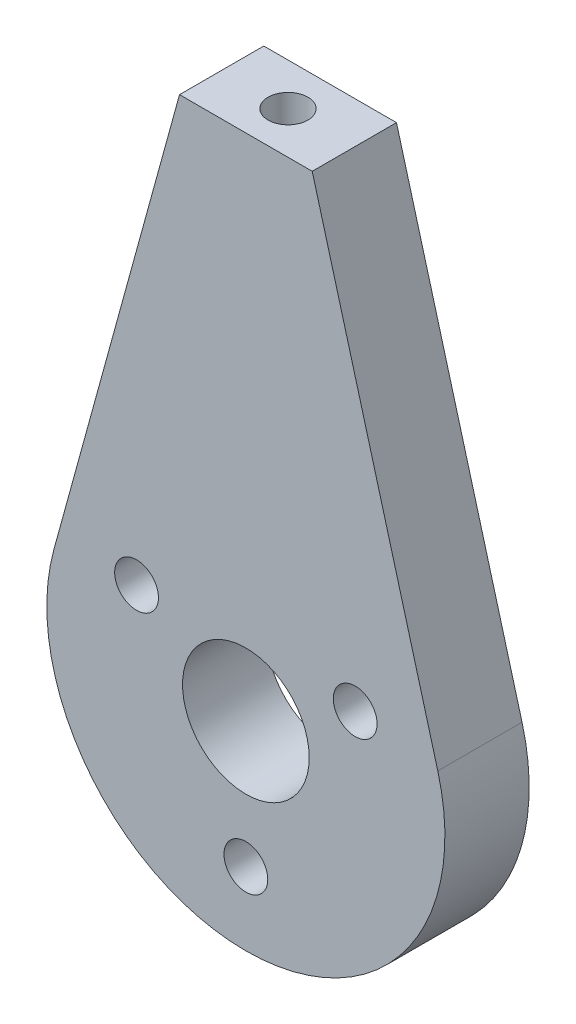
ISO-10303-21;
HEADER;
FILE_DESCRIPTION(('STEP AP214'),'2;1');
FILE_NAME('part.step','',(''),(''),'','','');
FILE_SCHEMA(('AUTOMOTIVE_DESIGN { 1 0 10303 214 1 1 1 1 }'));
ENDSEC;
DATA;
#1=APPLICATION_CONTEXT('core data for automotive mechanical design processes');
#2=APPLICATION_PROTOCOL_DEFINITION('international standard','automotive_design',2000,#1);
#3=PRODUCT_CONTEXT('',#1,'mechanical');
#4=PRODUCT('Part','Part','',(#3));
#5=PRODUCT_RELATED_PRODUCT_CATEGORY('part','',(#4));
#6=PRODUCT_DEFINITION_FORMATION('','',#4);
#7=PRODUCT_DEFINITION_CONTEXT('part definition',#1,'design');
#8=PRODUCT_DEFINITION('design','',#6,#7);
#9=PRODUCT_DEFINITION_SHAPE('','',#8);
#10=(LENGTH_UNIT() NAMED_UNIT(*) SI_UNIT(.MILLI.,.METRE.));
#11=(NAMED_UNIT(*) PLANE_ANGLE_UNIT() SI_UNIT($,.RADIAN.));
#12=(NAMED_UNIT(*) SI_UNIT($,.STERADIAN.) SOLID_ANGLE_UNIT());
#13=UNCERTAINTY_MEASURE_WITH_UNIT(LENGTH_MEASURE(1.E-05),#10,'distance_accuracy_value','');
#14=(GEOMETRIC_REPRESENTATION_CONTEXT(3) GLOBAL_UNCERTAINTY_ASSIGNED_CONTEXT((#13)) GLOBAL_UNIT_ASSIGNED_CONTEXT((#10,
#11,#12)) REPRESENTATION_CONTEXT('',''));
#15=CARTESIAN_POINT('',(0.,0.,0.));
#16=DIRECTION('',(0.,0.,1.));
#17=DIRECTION('',(1.,0.,0.));
#18=AXIS2_PLACEMENT_3D('',#15,#16,#17);
#19=CARTESIAN_POINT('',(-14.4628281295073,3.97826626765148,3.175));
#20=DIRECTION('',(0.964188541967151,-0.265217751176765,0.));
#21=DIRECTION('',(0.265217751176765,0.964188541967151,0.));
#22=AXIS2_PLACEMENT_3D('',#19,#20,#21);
#23=PLANE('',#22);
#24=DIRECTION('',(-0.265217751176765,-0.964188541967151,0.));
#25=VECTOR('',#24,1.);
#26=CARTESIAN_POINT('',(-14.4628281295073,3.97826626765148,-3.175));
#27=LINE('',#26,#25);
#28=CARTESIAN_POINT('',(-5.,38.38,-3.175));
#29=VERTEX_POINT('',#28);
#30=CARTESIAN_POINT('',(-14.4628281295073,3.97826626765148,-3.175));
#31=VERTEX_POINT('',#30);
#32=EDGE_CURVE('E108',#29,#31,#27,.T.);
#33=ORIENTED_EDGE('',*,*,#32,.T.);
#34=DIRECTION('',(0.,0.,-1.));
#35=VECTOR('',#34,1.);
#36=CARTESIAN_POINT('',(-14.4628281295073,3.97826626765148,3.175));
#37=LINE('',#36,#35);
#38=CARTESIAN_POINT('',(-14.4628281295073,3.97826626765148,3.175));
#39=VERTEX_POINT('',#38);
#40=EDGE_CURVE('E11',#39,#31,#37,.T.);
#41=ORIENTED_EDGE('',*,*,#40,.F.);
#42=DIRECTION('',(-0.265217751176765,-0.964188541967151,0.));
#43=VECTOR('',#42,1.);
#44=CARTESIAN_POINT('',(-14.4628281295073,3.97826626765148,3.175));
#45=LINE('',#44,#43);
#46=CARTESIAN_POINT('',(-5.,38.38,3.175));
#47=VERTEX_POINT('',#46);
#48=EDGE_CURVE('E94',#47,#39,#45,.T.);
#49=ORIENTED_EDGE('',*,*,#48,.F.);
#50=DIRECTION('',(0.,0.,-1.));
#51=VECTOR('',#50,1.);
#52=CARTESIAN_POINT('',(-5.,38.38,3.175));
#53=LINE('',#52,#51);
#54=EDGE_CURVE('E61',#47,#29,#53,.T.);
#55=ORIENTED_EDGE('',*,*,#54,.T.);
#56=EDGE_LOOP('',(#33,#41,#49,#55));
#57=FACE_BOUND('',#56,.T.);
#58=ADVANCED_FACE('F45',(#57),#23,.F.);
#59=CARTESIAN_POINT('',(0.,0.,3.175));
#60=DIRECTION('',(0.,0.,-1.));
#61=DIRECTION('',(-1.,0.,0.));
#62=AXIS2_PLACEMENT_3D('',#59,#60,#61);
#63=CYLINDRICAL_SURFACE('',#62,15.);
#64=CARTESIAN_POINT('',(0.,0.,-3.175));
#65=DIRECTION('',(0.,0.,1.));
#66=DIRECTION('',(1.,0.,0.));
#67=AXIS2_PLACEMENT_3D('',#64,#65,#66);
#68=CIRCLE('',#67,15.);
#69=CARTESIAN_POINT('',(14.4628281295073,3.97826626765148,-3.175));
#70=VERTEX_POINT('',#69);
#71=EDGE_CURVE('E99',#31,#70,#68,.T.);
#72=ORIENTED_EDGE('',*,*,#71,.T.);
#73=DIRECTION('',(0.,0.,-1.));
#74=VECTOR('',#73,1.);
#75=CARTESIAN_POINT('',(14.4628281295073,3.97826626765148,3.175));
#76=LINE('',#75,#74);
#77=CARTESIAN_POINT('',(14.4628281295073,3.97826626765148,3.175));
#78=VERTEX_POINT('',#77);
#79=EDGE_CURVE('E53',#78,#70,#76,.T.);
#80=ORIENTED_EDGE('',*,*,#79,.F.);
#81=CARTESIAN_POINT('',(0.,0.,3.175));
#82=DIRECTION('',(0.,0.,1.));
#83=DIRECTION('',(1.,0.,0.));
#84=AXIS2_PLACEMENT_3D('',#81,#82,#83);
#85=CIRCLE('',#84,15.);
#86=EDGE_CURVE('E86',#39,#78,#85,.T.);
#87=ORIENTED_EDGE('',*,*,#86,.F.);
#88=ORIENTED_EDGE('',*,*,#40,.T.);
#89=EDGE_LOOP('',(#72,#80,#87,#88));
#90=FACE_BOUND('',#89,.T.);
#91=ADVANCED_FACE('F98',(#90),#63,.T.);
#92=CARTESIAN_POINT('',(14.4628281295073,3.97826626765148,3.175));
#93=DIRECTION('',(0.964188541967151,0.265217751176765,0.));
#94=DIRECTION('',(-0.265217751176765,0.964188541967151,0.));
#95=AXIS2_PLACEMENT_3D('',#92,#93,#94);
#96=PLANE('',#95);
#97=DIRECTION('',(0.265217751176765,-0.964188541967151,0.));
#98=VECTOR('',#97,1.);
#99=CARTESIAN_POINT('',(14.4628281295073,3.97826626765148,-3.175));
#100=LINE('',#99,#98);
#101=CARTESIAN_POINT('',(5.,38.38,-3.175));
#102=VERTEX_POINT('',#101);
#103=EDGE_CURVE('E112',#102,#70,#100,.T.);
#104=ORIENTED_EDGE('',*,*,#103,.F.);
#105=DIRECTION('',(0.,0.,-1.));
#106=VECTOR('',#105,1.);
#107=CARTESIAN_POINT('',(5.,38.38,3.175));
#108=LINE('',#107,#106);
#109=CARTESIAN_POINT('',(5.,38.38,3.175));
#110=VERTEX_POINT('',#109);
#111=EDGE_CURVE('E75',#110,#102,#108,.T.);
#112=ORIENTED_EDGE('',*,*,#111,.F.);
#113=DIRECTION('',(0.265217751176765,-0.964188541967151,0.));
#114=VECTOR('',#113,1.);
#115=CARTESIAN_POINT('',(14.4628281295073,3.97826626765148,3.175));
#116=LINE('',#115,#114);
#117=EDGE_CURVE('E93',#110,#78,#116,.T.);
#118=ORIENTED_EDGE('',*,*,#117,.T.);
#119=ORIENTED_EDGE('',*,*,#79,.T.);
#120=EDGE_LOOP('',(#104,#112,#118,#119));
#121=FACE_BOUND('',#120,.T.);
#122=ADVANCED_FACE('F102',(#121),#96,.T.);
#123=CARTESIAN_POINT('',(0.,38.38,3.175));
#124=DIRECTION('',(0.,1.,0.));
#125=DIRECTION('',(0.,0.,1.));
#126=AXIS2_PLACEMENT_3D('',#123,#124,#125);
#127=PLANE('',#126);
#128=CARTESIAN_POINT('',(0.,38.38,0.));
#129=DIRECTION('',(0.,1.,0.));
#130=DIRECTION('',(0.,0.,1.));
#131=AXIS2_PLACEMENT_3D('',#128,#129,#130);
#132=CIRCLE('',#131,1.5);
#133=CARTESIAN_POINT('',(0.,38.38,1.5));
#134=VERTEX_POINT('',#133);
#135=EDGE_CURVE('E126',#134,#134,#132,.T.);
#136=ORIENTED_EDGE('',*,*,#135,.F.);
#137=EDGE_LOOP('',(#136));
#138=FACE_BOUND('',#137,.T.);
#139=DIRECTION('',(1.,0.,0.));
#140=VECTOR('',#139,1.);
#141=CARTESIAN_POINT('',(0.,38.38,-3.175));
#142=LINE('',#141,#140);
#143=EDGE_CURVE('E114',#29,#102,#142,.T.);
#144=ORIENTED_EDGE('',*,*,#143,.F.);
#145=ORIENTED_EDGE('',*,*,#54,.F.);
#146=DIRECTION('',(1.,0.,0.));
#147=VECTOR('',#146,1.);
#148=CARTESIAN_POINT('',(0.,38.38,3.175));
#149=LINE('',#148,#147);
#150=EDGE_CURVE('E103',#47,#110,#149,.T.);
#151=ORIENTED_EDGE('',*,*,#150,.T.);
#152=ORIENTED_EDGE('',*,*,#111,.T.);
#153=EDGE_LOOP('',(#144,#145,#151,#152));
#154=FACE_BOUND('',#153,.T.);
#155=ADVANCED_FACE('F162',(#138,#154),#127,.T.);
#156=CARTESIAN_POINT('',(0.,0.,3.175));
#157=DIRECTION('',(0.,0.,1.));
#158=DIRECTION('',(1.,0.,0.));
#159=AXIS2_PLACEMENT_3D('',#156,#157,#158);
#160=PLANE('',#159);
#161=CARTESIAN_POINT('',(0.,-9.5125,3.175));
#162=DIRECTION('',(0.,0.,1.));
#163=DIRECTION('',(1.,0.,0.));
#164=AXIS2_PLACEMENT_3D('',#161,#162,#163);
#165=CIRCLE('',#164,1.65);
#166=CARTESIAN_POINT('',(1.65,-9.5125,3.175));
#167=VERTEX_POINT('',#166);
#168=EDGE_CURVE('E144',#167,#167,#165,.T.);
#169=ORIENTED_EDGE('',*,*,#168,.F.);
#170=EDGE_LOOP('',(#169));
#171=FACE_BOUND('',#170,.T.);
#172=CARTESIAN_POINT('',(-8.23806665349947,4.75625,3.175));
#173=DIRECTION('',(0.,0.,1.));
#174=DIRECTION('',(1.,0.,0.));
#175=AXIS2_PLACEMENT_3D('',#172,#173,#174);
#176=CIRCLE('',#175,1.65);
#177=CARTESIAN_POINT('',(-6.58806665349947,4.75625,3.175));
#178=VERTEX_POINT('',#177);
#179=EDGE_CURVE('E141',#178,#178,#176,.T.);
#180=ORIENTED_EDGE('',*,*,#179,.F.);
#181=EDGE_LOOP('',(#180));
#182=FACE_BOUND('',#181,.T.);
#183=CARTESIAN_POINT('',(8.23806665349947,4.75625,3.175));
#184=DIRECTION('',(0.,0.,1.));
#185=DIRECTION('',(1.,0.,0.));
#186=AXIS2_PLACEMENT_3D('',#183,#184,#185);
#187=CIRCLE('',#186,1.65);
#188=CARTESIAN_POINT('',(9.88806665349947,4.75625,3.175));
#189=VERTEX_POINT('',#188);
#190=EDGE_CURVE('E135',#189,#189,#187,.T.);
#191=ORIENTED_EDGE('',*,*,#190,.F.);
#192=EDGE_LOOP('',(#191));
#193=FACE_BOUND('',#192,.T.);
#194=CARTESIAN_POINT('',(0.,0.,3.175));
#195=DIRECTION('',(0.,0.,1.));
#196=DIRECTION('',(1.,0.,0.));
#197=AXIS2_PLACEMENT_3D('',#194,#195,#196);
#198=CIRCLE('',#197,4.77266);
#199=CARTESIAN_POINT('',(4.77266,0.,3.175));
#200=VERTEX_POINT('',#199);
#201=EDGE_CURVE('E120',#200,#200,#198,.T.);
#202=ORIENTED_EDGE('',*,*,#201,.F.);
#203=EDGE_LOOP('',(#202));
#204=FACE_BOUND('',#203,.T.);
#205=ORIENTED_EDGE('',*,*,#48,.T.);
#206=ORIENTED_EDGE('',*,*,#86,.T.);
#207=ORIENTED_EDGE('',*,*,#117,.F.);
#208=ORIENTED_EDGE('',*,*,#150,.F.);
#209=EDGE_LOOP('',(#205,#206,#207,#208));
#210=FACE_BOUND('',#209,.T.);
#211=ADVANCED_FACE('F90',(#171,#182,#193,#204,#210),#160,.T.);
#212=CARTESIAN_POINT('',(0.,0.,-3.175));
#213=DIRECTION('',(0.,0.,1.));
#214=DIRECTION('',(1.,0.,0.));
#215=AXIS2_PLACEMENT_3D('',#212,#213,#214);
#216=PLANE('',#215);
#217=CARTESIAN_POINT('',(0.,-9.5125,-3.175));
#218=DIRECTION('',(0.,0.,1.));
#219=DIRECTION('',(1.,0.,0.));
#220=AXIS2_PLACEMENT_3D('',#217,#218,#219);
#221=CIRCLE('',#220,1.65);
#222=CARTESIAN_POINT('',(1.65,-9.5125,-3.175));
#223=VERTEX_POINT('',#222);
#224=EDGE_CURVE('E129',#223,#223,#221,.T.);
#225=ORIENTED_EDGE('',*,*,#224,.T.);
#226=EDGE_LOOP('',(#225));
#227=FACE_BOUND('',#226,.T.);
#228=CARTESIAN_POINT('',(-8.23806665349947,4.75625,-3.175));
#229=DIRECTION('',(0.,0.,1.));
#230=DIRECTION('',(1.,0.,0.));
#231=AXIS2_PLACEMENT_3D('',#228,#229,#230);
#232=CIRCLE('',#231,1.65);
#233=CARTESIAN_POINT('',(-6.58806665349947,4.75625,-3.175));
#234=VERTEX_POINT('',#233);
#235=EDGE_CURVE('E138',#234,#234,#232,.T.);
#236=ORIENTED_EDGE('',*,*,#235,.T.);
#237=EDGE_LOOP('',(#236));
#238=FACE_BOUND('',#237,.T.);
#239=CARTESIAN_POINT('',(8.23806665349947,4.75625,-3.175));
#240=DIRECTION('',(0.,0.,1.));
#241=DIRECTION('',(1.,0.,0.));
#242=AXIS2_PLACEMENT_3D('',#239,#240,#241);
#243=CIRCLE('',#242,1.65);
#244=CARTESIAN_POINT('',(9.88806665349947,4.75625,-3.175));
#245=VERTEX_POINT('',#244);
#246=EDGE_CURVE('E132',#245,#245,#243,.T.);
#247=ORIENTED_EDGE('',*,*,#246,.T.);
#248=EDGE_LOOP('',(#247));
#249=FACE_BOUND('',#248,.T.);
#250=CARTESIAN_POINT('',(0.,0.,-3.175));
#251=DIRECTION('',(0.,0.,1.));
#252=DIRECTION('',(1.,0.,0.));
#253=AXIS2_PLACEMENT_3D('',#250,#251,#252);
#254=CIRCLE('',#253,4.77266);
#255=CARTESIAN_POINT('',(4.77266,0.,-3.175));
#256=VERTEX_POINT('',#255);
#257=EDGE_CURVE('E110',#256,#256,#254,.T.);
#258=ORIENTED_EDGE('',*,*,#257,.T.);
#259=EDGE_LOOP('',(#258));
#260=FACE_BOUND('',#259,.T.);
#261=ORIENTED_EDGE('',*,*,#32,.F.);
#262=ORIENTED_EDGE('',*,*,#143,.T.);
#263=ORIENTED_EDGE('',*,*,#103,.T.);
#264=ORIENTED_EDGE('',*,*,#71,.F.);
#265=EDGE_LOOP('',(#261,#262,#263,#264));
#266=FACE_BOUND('',#265,.T.);
#267=ADVANCED_FACE('F150',(#227,#238,#249,#260,#266),#216,.F.);
#268=CARTESIAN_POINT('',(0.,0.,-3.175));
#269=DIRECTION('',(0.,0.,1.));
#270=DIRECTION('',(1.,0.,0.));
#271=AXIS2_PLACEMENT_3D('',#268,#269,#270);
#272=CYLINDRICAL_SURFACE('',#271,4.77266);
#273=ORIENTED_EDGE('',*,*,#257,.F.);
#274=EDGE_LOOP('',(#273));
#275=FACE_BOUND('',#274,.T.);
#276=ORIENTED_EDGE('',*,*,#201,.T.);
#277=EDGE_LOOP('',(#276));
#278=FACE_BOUND('',#277,.T.);
#279=ADVANCED_FACE('F170',(#275,#278),#272,.F.);
#280=CARTESIAN_POINT('',(0.,24.38,0.));
#281=DIRECTION('',(0.,1.,0.));
#282=DIRECTION('',(0.,0.,1.));
#283=AXIS2_PLACEMENT_3D('',#280,#281,#282);
#284=CYLINDRICAL_SURFACE('',#283,1.5);
#285=CARTESIAN_POINT('',(0.,24.38,0.));
#286=DIRECTION('',(0.,1.,0.));
#287=DIRECTION('',(0.,0.,1.));
#288=AXIS2_PLACEMENT_3D('',#285,#286,#287);
#289=CIRCLE('',#288,1.5);
#290=CARTESIAN_POINT('',(0.,24.38,1.5));
#291=VERTEX_POINT('',#290);
#292=EDGE_CURVE('E123',#291,#291,#289,.T.);
#293=ORIENTED_EDGE('',*,*,#292,.F.);
#294=EDGE_LOOP('',(#293));
#295=FACE_BOUND('',#294,.T.);
#296=ORIENTED_EDGE('',*,*,#135,.T.);
#297=EDGE_LOOP('',(#296));
#298=FACE_BOUND('',#297,.T.);
#299=ADVANCED_FACE('F172',(#295,#298),#284,.F.);
#300=CARTESIAN_POINT('',(0.,24.38,0.));
#301=DIRECTION('',(0.,1.,0.));
#302=DIRECTION('',(0.,0.,1.));
#303=AXIS2_PLACEMENT_3D('',#300,#301,#302);
#304=PLANE('',#303);
#305=ORIENTED_EDGE('',*,*,#292,.T.);
#306=EDGE_LOOP('',(#305));
#307=FACE_BOUND('',#306,.T.);
#308=ADVANCED_FACE('F180',(#307),#304,.T.);
#309=CARTESIAN_POINT('',(8.23806665349947,4.75625,-3.175));
#310=DIRECTION('',(0.,0.,1.));
#311=DIRECTION('',(1.,0.,0.));
#312=AXIS2_PLACEMENT_3D('',#309,#310,#311);
#313=CYLINDRICAL_SURFACE('',#312,1.65);
#314=ORIENTED_EDGE('',*,*,#246,.F.);
#315=EDGE_LOOP('',(#314));
#316=FACE_BOUND('',#315,.T.);
#317=ORIENTED_EDGE('',*,*,#190,.T.);
#318=EDGE_LOOP('',(#317));
#319=FACE_BOUND('',#318,.T.);
#320=ADVANCED_FACE('F243',(#316,#319),#313,.F.);
#321=CARTESIAN_POINT('',(-8.23806665349947,4.75625,-3.175));
#322=DIRECTION('',(0.,0.,1.));
#323=DIRECTION('',(1.,0.,0.));
#324=AXIS2_PLACEMENT_3D('',#321,#322,#323);
#325=CYLINDRICAL_SURFACE('',#324,1.65);
#326=ORIENTED_EDGE('',*,*,#235,.F.);
#327=EDGE_LOOP('',(#326));
#328=FACE_BOUND('',#327,.T.);
#329=ORIENTED_EDGE('',*,*,#179,.T.);
#330=EDGE_LOOP('',(#329));
#331=FACE_BOUND('',#330,.T.);
#332=ADVANCED_FACE('F156',(#328,#331),#325,.F.);
#333=CARTESIAN_POINT('',(0.,-9.5125,-3.175));
#334=DIRECTION('',(0.,0.,1.));
#335=DIRECTION('',(1.,0.,0.));
#336=AXIS2_PLACEMENT_3D('',#333,#334,#335);
#337=CYLINDRICAL_SURFACE('',#336,1.65);
#338=ORIENTED_EDGE('',*,*,#224,.F.);
#339=EDGE_LOOP('',(#338));
#340=FACE_BOUND('',#339,.T.);
#341=ORIENTED_EDGE('',*,*,#168,.T.);
#342=EDGE_LOOP('',(#341));
#343=FACE_BOUND('',#342,.T.);
#344=ADVANCED_FACE('F153',(#340,#343),#337,.F.);
#345=CLOSED_SHELL('',(#58,#91,#122,#155,#211,#267,#279,#299,#308,#320,#332,#344));
#346=MANIFOLD_SOLID_BREP('B2',#345);
#347=ADVANCED_BREP_SHAPE_REPRESENTATION('',(#18,#346),#14);
#348=SHAPE_DEFINITION_REPRESENTATION(#9,#347);
ENDSEC;
END-ISO-10303-21;
